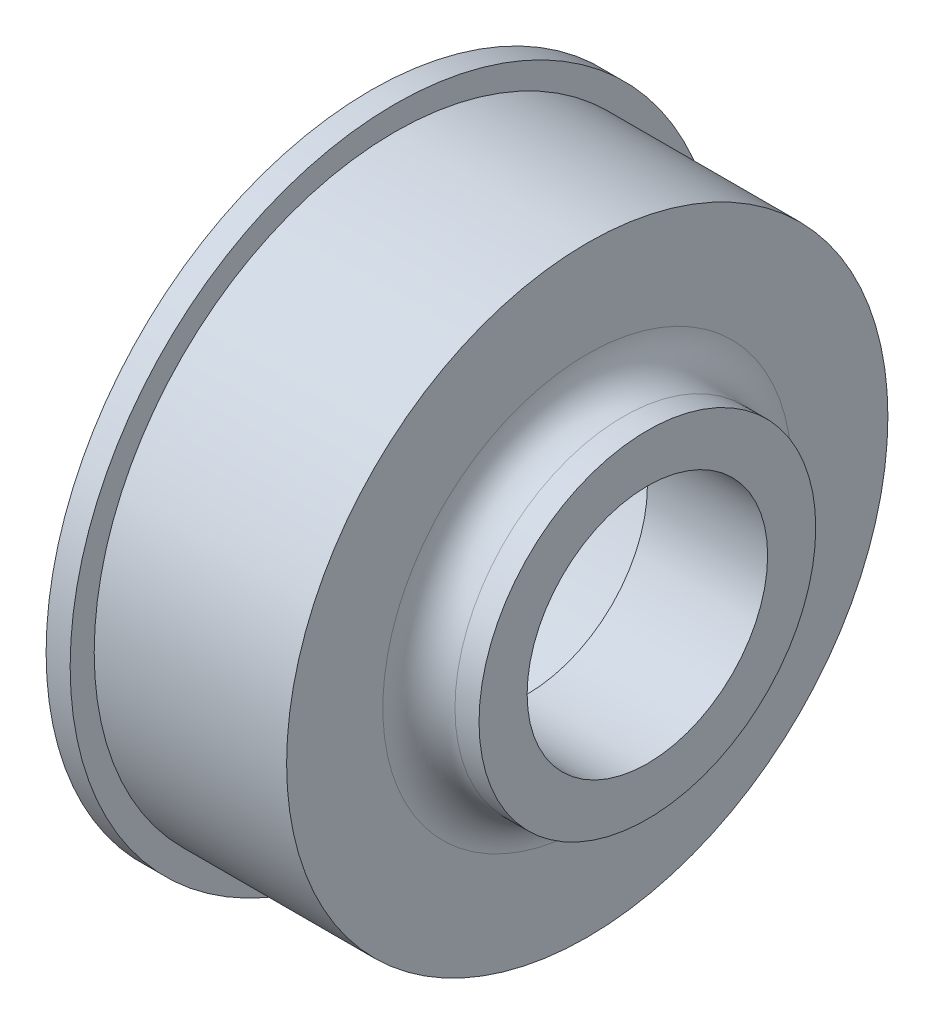
ISO-10303-21;
HEADER;
FILE_DESCRIPTION(('STEP AP214'),'2;1');
FILE_NAME('part.step','',(''),(''),'','','');
FILE_SCHEMA(('AUTOMOTIVE_DESIGN { 1 0 10303 214 1 1 1 1 }'));
ENDSEC;
DATA;
#1=APPLICATION_CONTEXT('core data for automotive mechanical design processes');
#2=APPLICATION_PROTOCOL_DEFINITION('international standard','automotive_design',2000,#1);
#3=PRODUCT_CONTEXT('',#1,'mechanical');
#4=PRODUCT('Part','Part','',(#3));
#5=PRODUCT_RELATED_PRODUCT_CATEGORY('part','',(#4));
#6=PRODUCT_DEFINITION_FORMATION('','',#4);
#7=PRODUCT_DEFINITION_CONTEXT('part definition',#1,'design');
#8=PRODUCT_DEFINITION('design','',#6,#7);
#9=PRODUCT_DEFINITION_SHAPE('','',#8);
#10=(LENGTH_UNIT() NAMED_UNIT(*) SI_UNIT(.MILLI.,.METRE.));
#11=(NAMED_UNIT(*) PLANE_ANGLE_UNIT() SI_UNIT($,.RADIAN.));
#12=(NAMED_UNIT(*) SI_UNIT($,.STERADIAN.) SOLID_ANGLE_UNIT());
#13=UNCERTAINTY_MEASURE_WITH_UNIT(LENGTH_MEASURE(1.E-05),#10,'distance_accuracy_value','');
#14=(GEOMETRIC_REPRESENTATION_CONTEXT(3) GLOBAL_UNCERTAINTY_ASSIGNED_CONTEXT((#13)) GLOBAL_UNIT_ASSIGNED_CONTEXT((#10,
#11,#12)) REPRESENTATION_CONTEXT('',''));
#15=CARTESIAN_POINT('',(0.,0.,0.));
#16=DIRECTION('',(0.,0.,1.));
#17=DIRECTION('',(1.,0.,0.));
#18=AXIS2_PLACEMENT_3D('',#15,#16,#17);
#19=CARTESIAN_POINT('',(9.20745327080814,0.,0.));
#20=DIRECTION('',(1.,0.,0.));
#21=DIRECTION('',(0.,0.,-1.));
#22=AXIS2_PLACEMENT_3D('',#19,#20,#21);
#23=CYLINDRICAL_SURFACE('',#22,10.);
#24=CARTESIAN_POINT('',(9.20745327080814,0.,0.));
#25=DIRECTION('',(1.,0.,0.));
#26=DIRECTION('',(0.,0.,-1.));
#27=AXIS2_PLACEMENT_3D('',#24,#25,#26);
#28=CIRCLE('',#27,10.);
#29=CARTESIAN_POINT('',(9.20745327080814,0.,-10.));
#30=VERTEX_POINT('',#29);
#31=EDGE_CURVE('E68',#30,#30,#28,.T.);
#32=ORIENTED_EDGE('',*,*,#31,.T.);
#33=EDGE_LOOP('',(#32));
#34=FACE_BOUND('',#33,.T.);
#35=CARTESIAN_POINT('',(-0.792546729191863,0.,0.));
#36=DIRECTION('',(1.,0.,0.));
#37=DIRECTION('',(0.,0.,-1.));
#38=AXIS2_PLACEMENT_3D('',#35,#36,#37);
#39=CIRCLE('',#38,10.);
#40=CARTESIAN_POINT('',(-0.792546729191863,0.,-10.));
#41=VERTEX_POINT('',#40);
#42=EDGE_CURVE('E10',#41,#41,#39,.T.);
#43=ORIENTED_EDGE('',*,*,#42,.F.);
#44=EDGE_LOOP('',(#43));
#45=FACE_BOUND('',#44,.T.);
#46=ADVANCED_FACE('F31',(#34,#45),#23,.F.);
#47=CARTESIAN_POINT('',(-0.792546729191863,10.,0.));
#48=DIRECTION('',(-1.,0.,0.));
#49=DIRECTION('',(0.,0.,1.));
#50=AXIS2_PLACEMENT_3D('',#47,#48,#49);
#51=PLANE('',#50);
#52=ORIENTED_EDGE('',*,*,#42,.T.);
#53=EDGE_LOOP('',(#52));
#54=FACE_BOUND('',#53,.T.);
#55=CARTESIAN_POINT('',(-0.792546729191863,0.,0.));
#56=DIRECTION('',(1.,0.,0.));
#57=DIRECTION('',(0.,0.,-1.));
#58=AXIS2_PLACEMENT_3D('',#55,#56,#57);
#59=CIRCLE('',#58,20.);
#60=CARTESIAN_POINT('',(-0.792546729191863,0.,-20.));
#61=VERTEX_POINT('',#60);
#62=EDGE_CURVE('E37',#61,#61,#59,.T.);
#63=ORIENTED_EDGE('',*,*,#62,.F.);
#64=EDGE_LOOP('',(#63));
#65=FACE_BOUND('',#64,.T.);
#66=ADVANCED_FACE('F86',(#54,#65),#51,.T.);
#67=CARTESIAN_POINT('',(9.20745327080814,0.,0.));
#68=DIRECTION('',(1.,0.,0.));
#69=DIRECTION('',(0.,0.,-1.));
#70=AXIS2_PLACEMENT_3D('',#67,#68,#69);
#71=CYLINDRICAL_SURFACE('',#70,20.);
#72=ORIENTED_EDGE('',*,*,#62,.T.);
#73=EDGE_LOOP('',(#72));
#74=FACE_BOUND('',#73,.T.);
#75=CARTESIAN_POINT('',(-13.7925467291919,0.,0.));
#76=DIRECTION('',(1.,0.,0.));
#77=DIRECTION('',(0.,0.,-1.));
#78=AXIS2_PLACEMENT_3D('',#75,#76,#77);
#79=CIRCLE('',#78,20.);
#80=CARTESIAN_POINT('',(-13.7925467291919,0.,-20.));
#81=VERTEX_POINT('',#80);
#82=EDGE_CURVE('E41',#81,#81,#79,.T.);
#83=ORIENTED_EDGE('',*,*,#82,.F.);
#84=EDGE_LOOP('',(#83));
#85=FACE_BOUND('',#84,.T.);
#86=ADVANCED_FACE('F90',(#74,#85),#71,.F.);
#87=CARTESIAN_POINT('',(-13.7925467291919,20.,0.));
#88=DIRECTION('',(-1.,0.,0.));
#89=DIRECTION('',(0.,0.,1.));
#90=AXIS2_PLACEMENT_3D('',#87,#88,#89);
#91=PLANE('',#90);
#92=ORIENTED_EDGE('',*,*,#82,.T.);
#93=EDGE_LOOP('',(#92));
#94=FACE_BOUND('',#93,.T.);
#95=CARTESIAN_POINT('',(-13.7925467291919,0.,0.));
#96=DIRECTION('',(1.,0.,0.));
#97=DIRECTION('',(0.,0.,-1.));
#98=AXIS2_PLACEMENT_3D('',#95,#96,#97);
#99=CIRCLE('',#98,27.);
#100=CARTESIAN_POINT('',(-13.7925467291919,0.,-27.));
#101=VERTEX_POINT('',#100);
#102=EDGE_CURVE('E45',#101,#101,#99,.T.);
#103=ORIENTED_EDGE('',*,*,#102,.F.);
#104=EDGE_LOOP('',(#103));
#105=FACE_BOUND('',#104,.T.);
#106=ADVANCED_FACE('F94',(#94,#105),#91,.T.);
#107=CARTESIAN_POINT('',(9.20745327080814,0.,0.));
#108=DIRECTION('',(1.,0.,0.));
#109=DIRECTION('',(0.,0.,-1.));
#110=AXIS2_PLACEMENT_3D('',#107,#108,#109);
#111=CYLINDRICAL_SURFACE('',#110,27.);
#112=ORIENTED_EDGE('',*,*,#102,.T.);
#113=EDGE_LOOP('',(#112));
#114=FACE_BOUND('',#113,.T.);
#115=CARTESIAN_POINT('',(-11.7925467291919,0.,0.));
#116=DIRECTION('',(1.,0.,0.));
#117=DIRECTION('',(0.,0.,-1.));
#118=AXIS2_PLACEMENT_3D('',#115,#116,#117);
#119=CIRCLE('',#118,27.);
#120=CARTESIAN_POINT('',(-11.7925467291919,0.,-27.));
#121=VERTEX_POINT('',#120);
#122=EDGE_CURVE('E50',#121,#121,#119,.T.);
#123=ORIENTED_EDGE('',*,*,#122,.F.);
#124=EDGE_LOOP('',(#123));
#125=FACE_BOUND('',#124,.T.);
#126=ADVANCED_FACE('F100',(#114,#125),#111,.T.);
#127=CARTESIAN_POINT('',(-11.7925467291919,27.,0.));
#128=DIRECTION('',(1.,0.,0.));
#129=DIRECTION('',(0.,0.,-1.));
#130=AXIS2_PLACEMENT_3D('',#127,#128,#129);
#131=PLANE('',#130);
#132=ORIENTED_EDGE('',*,*,#122,.T.);
#133=EDGE_LOOP('',(#132));
#134=FACE_BOUND('',#133,.T.);
#135=CARTESIAN_POINT('',(-11.7925467291919,0.,0.));
#136=DIRECTION('',(1.,0.,0.));
#137=DIRECTION('',(0.,0.,-1.));
#138=AXIS2_PLACEMENT_3D('',#135,#136,#137);
#139=CIRCLE('',#138,25.);
#140=CARTESIAN_POINT('',(-11.7925467291919,0.,-25.));
#141=VERTEX_POINT('',#140);
#142=EDGE_CURVE('E53',#141,#141,#139,.T.);
#143=ORIENTED_EDGE('',*,*,#142,.F.);
#144=EDGE_LOOP('',(#143));
#145=FACE_BOUND('',#144,.T.);
#146=ADVANCED_FACE('F104',(#134,#145),#131,.T.);
#147=CARTESIAN_POINT('',(9.20745327080814,0.,0.));
#148=DIRECTION('',(1.,0.,0.));
#149=DIRECTION('',(0.,0.,-1.));
#150=AXIS2_PLACEMENT_3D('',#147,#148,#149);
#151=CYLINDRICAL_SURFACE('',#150,25.);
#152=ORIENTED_EDGE('',*,*,#142,.T.);
#153=EDGE_LOOP('',(#152));
#154=FACE_BOUND('',#153,.T.);
#155=CARTESIAN_POINT('',(4.20745327080814,0.,0.));
#156=DIRECTION('',(1.,0.,0.));
#157=DIRECTION('',(0.,0.,-1.));
#158=AXIS2_PLACEMENT_3D('',#155,#156,#157);
#159=CIRCLE('',#158,25.);
#160=CARTESIAN_POINT('',(4.20745327080814,0.,-25.));
#161=VERTEX_POINT('',#160);
#162=EDGE_CURVE('E56',#161,#161,#159,.T.);
#163=ORIENTED_EDGE('',*,*,#162,.F.);
#164=EDGE_LOOP('',(#163));
#165=FACE_BOUND('',#164,.T.);
#166=ADVANCED_FACE('F108',(#154,#165),#151,.T.);
#167=CARTESIAN_POINT('',(4.20745327080814,17.,0.));
#168=DIRECTION('',(1.,0.,0.));
#169=DIRECTION('',(0.,0.,-1.));
#170=AXIS2_PLACEMENT_3D('',#167,#168,#169);
#171=PLANE('',#170);
#172=ORIENTED_EDGE('',*,*,#162,.T.);
#173=EDGE_LOOP('',(#172));
#174=FACE_BOUND('',#173,.T.);
#175=CARTESIAN_POINT('',(4.20745327080814,0.,0.));
#176=DIRECTION('',(1.,0.,0.));
#177=DIRECTION('',(0.,0.,-1.));
#178=AXIS2_PLACEMENT_3D('',#175,#176,#177);
#179=CIRCLE('',#178,17.);
#180=CARTESIAN_POINT('',(4.20745327080814,0.,-17.));
#181=VERTEX_POINT('',#180);
#182=EDGE_CURVE('E59',#181,#181,#179,.T.);
#183=ORIENTED_EDGE('',*,*,#182,.F.);
#184=EDGE_LOOP('',(#183));
#185=FACE_BOUND('',#184,.T.);
#186=ADVANCED_FACE('F112',(#174,#185),#171,.T.);
#187=CARTESIAN_POINT('',(7.20745327080814,0.,0.));
#188=DIRECTION('',(1.,0.,0.));
#189=DIRECTION('',(0.,0.,-1.));
#190=AXIS2_PLACEMENT_3D('',#187,#188,#189);
#191=TOROIDAL_SURFACE('',#190,17.,3.);
#192=ORIENTED_EDGE('',*,*,#182,.T.);
#193=EDGE_LOOP('',(#192));
#194=FACE_BOUND('',#193,.T.);
#195=CARTESIAN_POINT('',(7.20745327080816,0.,0.));
#196=DIRECTION('',(1.,0.,0.));
#197=DIRECTION('',(0.,0.,-1.));
#198=AXIS2_PLACEMENT_3D('',#195,#196,#197);
#199=CIRCLE('',#198,14.);
#200=CARTESIAN_POINT('',(7.20745327080816,0.,-14.));
#201=VERTEX_POINT('',#200);
#202=EDGE_CURVE('E62',#201,#201,#199,.T.);
#203=ORIENTED_EDGE('',*,*,#202,.F.);
#204=EDGE_LOOP('',(#203));
#205=FACE_BOUND('',#204,.T.);
#206=ADVANCED_FACE('F82',(#194,#205),#191,.F.);
#207=CARTESIAN_POINT('',(9.20745327080814,0.,0.));
#208=DIRECTION('',(1.,0.,0.));
#209=DIRECTION('',(0.,0.,-1.));
#210=AXIS2_PLACEMENT_3D('',#207,#208,#209);
#211=CYLINDRICAL_SURFACE('',#210,14.);
#212=ORIENTED_EDGE('',*,*,#202,.T.);
#213=EDGE_LOOP('',(#212));
#214=FACE_BOUND('',#213,.T.);
#215=CARTESIAN_POINT('',(9.20745327080814,0.,0.));
#216=DIRECTION('',(1.,0.,0.));
#217=DIRECTION('',(0.,0.,-1.));
#218=AXIS2_PLACEMENT_3D('',#215,#216,#217);
#219=CIRCLE('',#218,14.);
#220=CARTESIAN_POINT('',(9.20745327080814,0.,-14.));
#221=VERTEX_POINT('',#220);
#222=EDGE_CURVE('E65',#221,#221,#219,.T.);
#223=ORIENTED_EDGE('',*,*,#222,.F.);
#224=EDGE_LOOP('',(#223));
#225=FACE_BOUND('',#224,.T.);
#226=ADVANCED_FACE('F76',(#214,#225),#211,.T.);
#227=CARTESIAN_POINT('',(9.20745327080814,10.,0.));
#228=DIRECTION('',(1.,0.,0.));
#229=DIRECTION('',(0.,0.,-1.));
#230=AXIS2_PLACEMENT_3D('',#227,#228,#229);
#231=PLANE('',#230);
#232=ORIENTED_EDGE('',*,*,#222,.T.);
#233=EDGE_LOOP('',(#232));
#234=FACE_BOUND('',#233,.T.);
#235=ORIENTED_EDGE('',*,*,#31,.F.);
#236=EDGE_LOOP('',(#235));
#237=FACE_BOUND('',#236,.T.);
#238=ADVANCED_FACE('F74',(#234,#237),#231,.T.);
#239=CLOSED_SHELL('',(#46,#66,#86,#106,#126,#146,#166,#186,#206,#226,#238));
#240=MANIFOLD_SOLID_BREP('B2',#239);
#241=ADVANCED_BREP_SHAPE_REPRESENTATION('',(#18,#240),#14);
#242=SHAPE_DEFINITION_REPRESENTATION(#9,#241);
ENDSEC;
END-ISO-10303-21;
